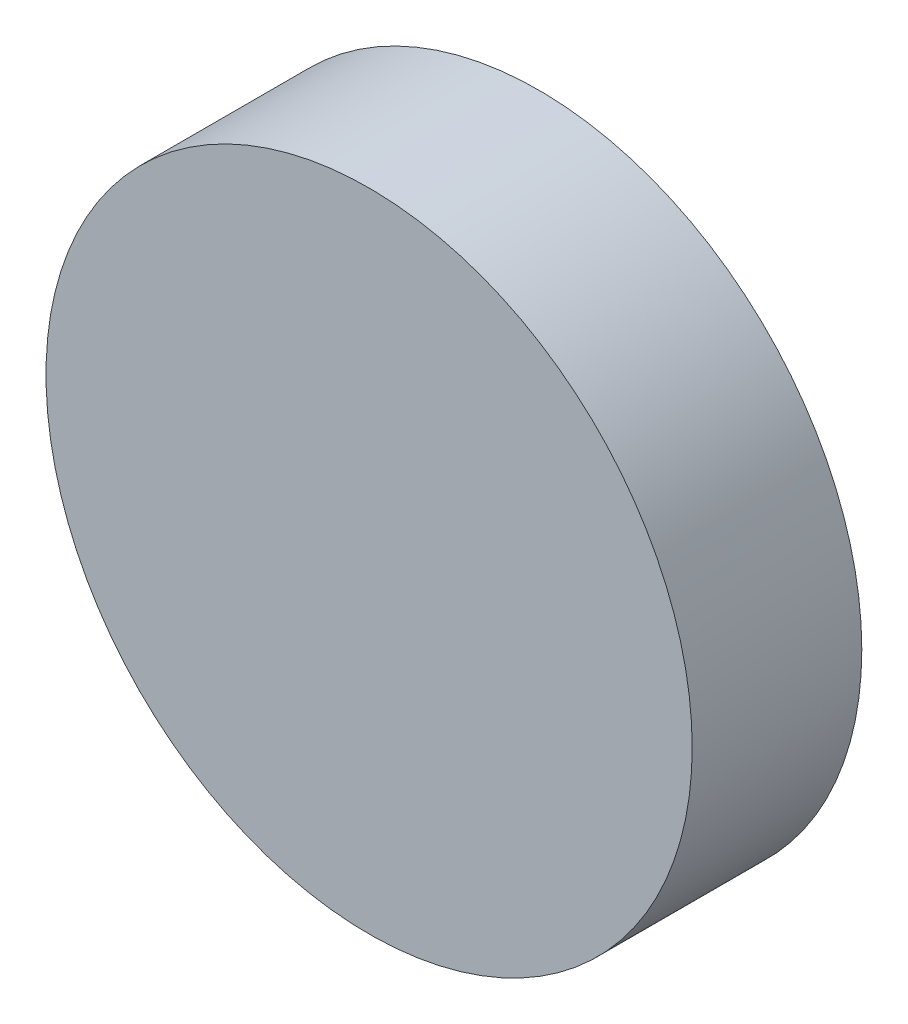
ISO-10303-21;
HEADER;
FILE_DESCRIPTION(('STEP AP214'),'2;1');
FILE_NAME('part.step','',(''),(''),'','','');
FILE_SCHEMA(('AUTOMOTIVE_DESIGN { 1 0 10303 214 1 1 1 1 }'));
ENDSEC;
DATA;
#1=APPLICATION_CONTEXT('core data for automotive mechanical design processes');
#2=APPLICATION_PROTOCOL_DEFINITION('international standard','automotive_design',2000,#1);
#3=PRODUCT_CONTEXT('',#1,'mechanical');
#4=PRODUCT('Part','Part','',(#3));
#5=PRODUCT_RELATED_PRODUCT_CATEGORY('part','',(#4));
#6=PRODUCT_DEFINITION_FORMATION('','',#4);
#7=PRODUCT_DEFINITION_CONTEXT('part definition',#1,'design');
#8=PRODUCT_DEFINITION('design','',#6,#7);
#9=PRODUCT_DEFINITION_SHAPE('','',#8);
#10=(LENGTH_UNIT() NAMED_UNIT(*) SI_UNIT(.MILLI.,.METRE.));
#11=(NAMED_UNIT(*) PLANE_ANGLE_UNIT() SI_UNIT($,.RADIAN.));
#12=(NAMED_UNIT(*) SI_UNIT($,.STERADIAN.) SOLID_ANGLE_UNIT());
#13=UNCERTAINTY_MEASURE_WITH_UNIT(LENGTH_MEASURE(1.E-05),#10,'distance_accuracy_value','');
#14=(GEOMETRIC_REPRESENTATION_CONTEXT(3) GLOBAL_UNCERTAINTY_ASSIGNED_CONTEXT((#13)) GLOBAL_UNIT_ASSIGNED_CONTEXT((#10,
#11,#12)) REPRESENTATION_CONTEXT('',''));
#15=CARTESIAN_POINT('',(0.,0.,0.));
#16=DIRECTION('',(0.,0.,1.));
#17=DIRECTION('',(1.,0.,0.));
#18=AXIS2_PLACEMENT_3D('',#15,#16,#17);
#19=CARTESIAN_POINT('',(0.,0.,10.));
#20=DIRECTION('',(0.,0.,-1.));
#21=DIRECTION('',(-1.,0.,0.));
#22=AXIS2_PLACEMENT_3D('',#19,#20,#21);
#23=CYLINDRICAL_SURFACE('',#22,19.05);
#24=CARTESIAN_POINT('',(0.,0.,10.));
#25=DIRECTION('',(0.,0.,1.));
#26=DIRECTION('',(1.,0.,0.));
#27=AXIS2_PLACEMENT_3D('',#24,#25,#26);
#28=CIRCLE('',#27,19.05);
#29=CARTESIAN_POINT('',(19.05,0.,10.));
#30=VERTEX_POINT('',#29);
#31=EDGE_CURVE('E10',#30,#30,#28,.T.);
#32=ORIENTED_EDGE('',*,*,#31,.F.);
#33=EDGE_LOOP('',(#32));
#34=FACE_BOUND('',#33,.T.);
#35=CARTESIAN_POINT('',(0.,0.,0.));
#36=DIRECTION('',(0.,0.,1.));
#37=DIRECTION('',(1.,0.,0.));
#38=AXIS2_PLACEMENT_3D('',#35,#36,#37);
#39=CIRCLE('',#38,19.05);
#40=CARTESIAN_POINT('',(19.05,0.,0.));
#41=VERTEX_POINT('',#40);
#42=EDGE_CURVE('E38',#41,#41,#39,.T.);
#43=ORIENTED_EDGE('',*,*,#42,.T.);
#44=EDGE_LOOP('',(#43));
#45=FACE_BOUND('',#44,.T.);
#46=ADVANCED_FACE('F35',(#34,#45),#23,.T.);
#47=CARTESIAN_POINT('',(0.,0.,10.));
#48=DIRECTION('',(0.,0.,1.));
#49=DIRECTION('',(1.,0.,0.));
#50=AXIS2_PLACEMENT_3D('',#47,#48,#49);
#51=PLANE('',#50);
#52=ORIENTED_EDGE('',*,*,#31,.T.);
#53=EDGE_LOOP('',(#52));
#54=FACE_BOUND('',#53,.T.);
#55=ADVANCED_FACE('F50',(#54),#51,.T.);
#56=CARTESIAN_POINT('',(0.,0.,0.));
#57=DIRECTION('',(0.,0.,1.));
#58=DIRECTION('',(1.,0.,0.));
#59=AXIS2_PLACEMENT_3D('',#56,#57,#58);
#60=PLANE('',#59);
#61=ORIENTED_EDGE('',*,*,#42,.F.);
#62=EDGE_LOOP('',(#61));
#63=FACE_BOUND('',#62,.T.);
#64=ADVANCED_FACE('F48',(#63),#60,.F.);
#65=CLOSED_SHELL('',(#46,#55,#64));
#66=MANIFOLD_SOLID_BREP('B2',#65);
#67=ADVANCED_BREP_SHAPE_REPRESENTATION('',(#18,#66),#14);
#68=SHAPE_DEFINITION_REPRESENTATION(#9,#67);
ENDSEC;
END-ISO-10303-21;
